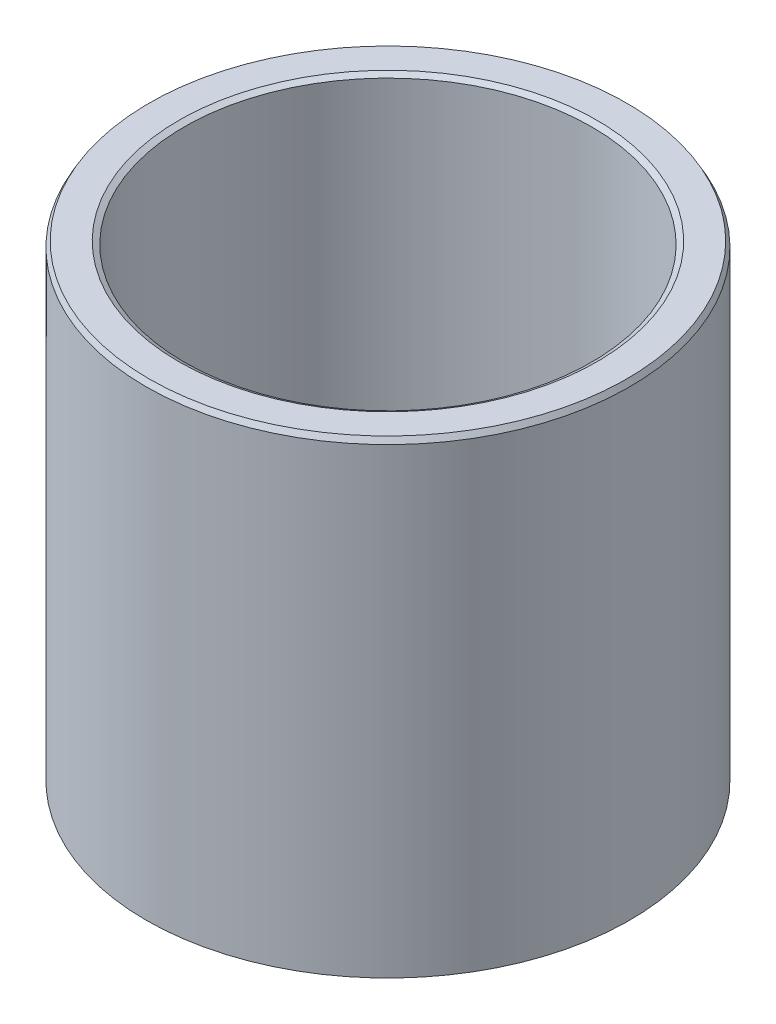
ISO-10303-21;
HEADER;
FILE_DESCRIPTION(('STEP AP214'),'2;1');
FILE_NAME('part.step','',(''),(''),'','','');
FILE_SCHEMA(('AUTOMOTIVE_DESIGN { 1 0 10303 214 1 1 1 1 }'));
ENDSEC;
DATA;
#1=APPLICATION_CONTEXT('core data for automotive mechanical design processes');
#2=APPLICATION_PROTOCOL_DEFINITION('international standard','automotive_design',2000,#1);
#3=PRODUCT_CONTEXT('',#1,'mechanical');
#4=PRODUCT('Part','Part','',(#3));
#5=PRODUCT_RELATED_PRODUCT_CATEGORY('part','',(#4));
#6=PRODUCT_DEFINITION_FORMATION('','',#4);
#7=PRODUCT_DEFINITION_CONTEXT('part definition',#1,'design');
#8=PRODUCT_DEFINITION('design','',#6,#7);
#9=PRODUCT_DEFINITION_SHAPE('','',#8);
#10=(LENGTH_UNIT() NAMED_UNIT(*) SI_UNIT(.MILLI.,.METRE.));
#11=(NAMED_UNIT(*) PLANE_ANGLE_UNIT() SI_UNIT($,.RADIAN.));
#12=(NAMED_UNIT(*) SI_UNIT($,.STERADIAN.) SOLID_ANGLE_UNIT());
#13=UNCERTAINTY_MEASURE_WITH_UNIT(LENGTH_MEASURE(1.E-05),#10,'distance_accuracy_value','');
#14=(GEOMETRIC_REPRESENTATION_CONTEXT(3) GLOBAL_UNCERTAINTY_ASSIGNED_CONTEXT((#13)) GLOBAL_UNIT_ASSIGNED_CONTEXT((#10,
#11,#12)) REPRESENTATION_CONTEXT('',''));
#15=CARTESIAN_POINT('',(0.,0.,0.));
#16=DIRECTION('',(0.,0.,1.));
#17=DIRECTION('',(1.,0.,0.));
#18=AXIS2_PLACEMENT_3D('',#15,#16,#17);
#19=CARTESIAN_POINT('',(0.,82.6490194078143,0.));
#20=DIRECTION('',(0.,-1.,0.));
#21=DIRECTION('',(0.,0.,-1.));
#22=AXIS2_PLACEMENT_3D('',#19,#20,#21);
#23=CYLINDRICAL_SURFACE('',#22,42.5);
#24=CARTESIAN_POINT('',(0.,0.527436922569194,0.));
#25=DIRECTION('',(0.,1.,0.));
#26=DIRECTION('',(0.,0.,1.));
#27=AXIS2_PLACEMENT_3D('',#24,#25,#26);
#28=CIRCLE('',#27,42.5);
#29=CARTESIAN_POINT('',(0.,0.527436922569194,42.5));
#30=VERTEX_POINT('',#29);
#31=EDGE_CURVE('E10',#30,#30,#28,.T.);
#32=ORIENTED_EDGE('',*,*,#31,.T.);
#33=EDGE_LOOP('',(#32));
#34=FACE_BOUND('',#33,.T.);
#35=CARTESIAN_POINT('',(0.,81.7123658292591,0.));
#36=DIRECTION('',(0.,1.,0.));
#37=DIRECTION('',(0.,0.,1.));
#38=AXIS2_PLACEMENT_3D('',#35,#36,#37);
#39=CIRCLE('',#38,42.5);
#40=CARTESIAN_POINT('',(0.,81.7123658292591,42.5));
#41=VERTEX_POINT('',#40);
#42=EDGE_CURVE('E50',#41,#41,#39,.F.);
#43=ORIENTED_EDGE('',*,*,#42,.T.);
#44=EDGE_LOOP('',(#43));
#45=FACE_BOUND('',#44,.T.);
#46=ADVANCED_FACE('F39',(#34,#45),#23,.T.);
#47=CARTESIAN_POINT('',(0.,82.6490194078143,0.));
#48=DIRECTION('',(0.,1.,0.));
#49=DIRECTION('',(0.,0.,1.));
#50=AXIS2_PLACEMENT_3D('',#47,#48,#49);
#51=PLANE('',#50);
#52=CARTESIAN_POINT('',(0.,82.6490194078143,0.));
#53=DIRECTION('',(0.,1.,0.));
#54=DIRECTION('',(0.,0.,1.));
#55=AXIS2_PLACEMENT_3D('',#52,#53,#54);
#56=CIRCLE('',#55,36.7487661700512);
#57=CARTESIAN_POINT('',(0.,82.6490194078143,36.7487661700512));
#58=VERTEX_POINT('',#57);
#59=EDGE_CURVE('E58',#58,#58,#56,.F.);
#60=ORIENTED_EDGE('',*,*,#59,.T.);
#61=EDGE_LOOP('',(#60));
#62=FACE_BOUND('',#61,.T.);
#63=CARTESIAN_POINT('',(0.,82.6490194078143,0.));
#64=DIRECTION('',(0.,1.,0.));
#65=DIRECTION('',(0.,0.,1.));
#66=AXIS2_PLACEMENT_3D('',#63,#64,#65);
#67=CIRCLE('',#66,41.9725630774308);
#68=CARTESIAN_POINT('',(0.,82.6490194078143,41.9725630774308));
#69=VERTEX_POINT('',#68);
#70=EDGE_CURVE('E61',#69,#69,#67,.T.);
#71=ORIENTED_EDGE('',*,*,#70,.T.);
#72=EDGE_LOOP('',(#71));
#73=FACE_BOUND('',#72,.T.);
#74=ADVANCED_FACE('F88',(#62,#73),#51,.T.);
#75=CARTESIAN_POINT('',(0.,0.,0.));
#76=DIRECTION('',(0.,1.,0.));
#77=DIRECTION('',(0.,0.,1.));
#78=AXIS2_PLACEMENT_3D('',#75,#76,#77);
#79=PLANE('',#78);
#80=CARTESIAN_POINT('',(0.,0.,0.));
#81=DIRECTION('',(0.,1.,0.));
#82=DIRECTION('',(0.,0.,1.));
#83=AXIS2_PLACEMENT_3D('',#80,#81,#82);
#84=CIRCLE('',#83,36.3395495140653);
#85=CARTESIAN_POINT('',(0.,0.,36.3395495140653));
#86=VERTEX_POINT('',#85);
#87=EDGE_CURVE('E51',#86,#86,#84,.T.);
#88=ORIENTED_EDGE('',*,*,#87,.T.);
#89=EDGE_LOOP('',(#88));
#90=FACE_BOUND('',#89,.T.);
#91=CARTESIAN_POINT('',(0.,0.,0.));
#92=DIRECTION('',(0.,1.,0.));
#93=DIRECTION('',(0.,0.,1.));
#94=AXIS2_PLACEMENT_3D('',#91,#92,#93);
#95=CIRCLE('',#94,41.5633464214449);
#96=CARTESIAN_POINT('',(0.,0.,41.5633464214449));
#97=VERTEX_POINT('',#96);
#98=EDGE_CURVE('E54',#97,#97,#95,.F.);
#99=ORIENTED_EDGE('',*,*,#98,.T.);
#100=EDGE_LOOP('',(#99));
#101=FACE_BOUND('',#100,.T.);
#102=ADVANCED_FACE('F83',(#90,#101),#79,.F.);
#103=CARTESIAN_POINT('',(0.,82.6490194078143,0.));
#104=DIRECTION('',(0.,-1.,0.));
#105=DIRECTION('',(0.,0.,-1.));
#106=AXIS2_PLACEMENT_3D('',#103,#104,#105);
#107=CYLINDRICAL_SURFACE('',#106,35.8121125914961);
#108=CARTESIAN_POINT('',(0.,82.1215824852451,0.));
#109=DIRECTION('',(0.,1.,0.));
#110=DIRECTION('',(0.,0.,1.));
#111=AXIS2_PLACEMENT_3D('',#108,#109,#110);
#112=CIRCLE('',#111,35.8121125914961);
#113=CARTESIAN_POINT('',(0.,82.1215824852451,35.8121125914961));
#114=VERTEX_POINT('',#113);
#115=EDGE_CURVE('E67',#114,#114,#112,.T.);
#116=ORIENTED_EDGE('',*,*,#115,.T.);
#117=EDGE_LOOP('',(#116));
#118=FACE_BOUND('',#117,.T.);
#119=CARTESIAN_POINT('',(0.,0.93665357855513,0.));
#120=DIRECTION('',(0.,1.,0.));
#121=DIRECTION('',(0.,0.,1.));
#122=AXIS2_PLACEMENT_3D('',#119,#120,#121);
#123=CIRCLE('',#122,35.8121125914961);
#124=CARTESIAN_POINT('',(0.,0.93665357855513,35.8121125914961));
#125=VERTEX_POINT('',#124);
#126=EDGE_CURVE('E69',#125,#125,#123,.F.);
#127=ORIENTED_EDGE('',*,*,#126,.T.);
#128=EDGE_LOOP('',(#127));
#129=FACE_BOUND('',#128,.T.);
#130=ADVANCED_FACE('F71',(#118,#129),#107,.F.);
#131=CARTESIAN_POINT('',(0.,82.1215824852451,0.));
#132=DIRECTION('',(0.,1.,0.));
#133=DIRECTION('',(0.,0.,1.));
#134=AXIS2_PLACEMENT_3D('',#131,#132,#133);
#135=CONICAL_SURFACE('',#134,35.8121125914961,1.05794528569812);
#136=ORIENTED_EDGE('',*,*,#59,.F.);
#137=EDGE_LOOP('',(#136));
#138=FACE_BOUND('',#137,.T.);
#139=ORIENTED_EDGE('',*,*,#115,.F.);
#140=EDGE_LOOP('',(#139));
#141=FACE_BOUND('',#140,.T.);
#142=ADVANCED_FACE('F77',(#138,#141),#135,.F.);
#143=CARTESIAN_POINT('',(0.,0.,0.));
#144=DIRECTION('',(0.,-1.,0.));
#145=DIRECTION('',(0.,0.,-1.));
#146=AXIS2_PLACEMENT_3D('',#143,#144,#145);
#147=CONICAL_SURFACE('',#146,36.3395495140653,0.51285104109678);
#148=ORIENTED_EDGE('',*,*,#126,.F.);
#149=EDGE_LOOP('',(#148));
#150=FACE_BOUND('',#149,.T.);
#151=ORIENTED_EDGE('',*,*,#87,.F.);
#152=EDGE_LOOP('',(#151));
#153=FACE_BOUND('',#152,.T.);
#154=ADVANCED_FACE('F73',(#150,#153),#147,.F.);
#155=CARTESIAN_POINT('',(0.,0.527436922569194,0.));
#156=DIRECTION('',(0.,1.,0.));
#157=DIRECTION('',(0.,0.,1.));
#158=AXIS2_PLACEMENT_3D('',#155,#156,#157);
#159=CONICAL_SURFACE('',#158,42.5,1.05794528569812);
#160=ORIENTED_EDGE('',*,*,#98,.F.);
#161=EDGE_LOOP('',(#160));
#162=FACE_BOUND('',#161,.T.);
#163=ORIENTED_EDGE('',*,*,#31,.F.);
#164=EDGE_LOOP('',(#163));
#165=FACE_BOUND('',#164,.T.);
#166=ADVANCED_FACE('F76',(#162,#165),#159,.T.);
#167=CARTESIAN_POINT('',(0.,82.6490194078143,0.));
#168=DIRECTION('',(0.,-1.,0.));
#169=DIRECTION('',(0.,0.,-1.));
#170=AXIS2_PLACEMENT_3D('',#167,#168,#169);
#171=CONICAL_SURFACE('',#170,41.9725630774308,0.512851041096774);
#172=ORIENTED_EDGE('',*,*,#42,.F.);
#173=EDGE_LOOP('',(#172));
#174=FACE_BOUND('',#173,.T.);
#175=ORIENTED_EDGE('',*,*,#70,.F.);
#176=EDGE_LOOP('',(#175));
#177=FACE_BOUND('',#176,.T.);
#178=ADVANCED_FACE('F45',(#174,#177),#171,.T.);
#179=CLOSED_SHELL('',(#46,#74,#102,#130,#142,#154,#166,#178));
#180=MANIFOLD_SOLID_BREP('B2',#179);
#181=ADVANCED_BREP_SHAPE_REPRESENTATION('',(#18,#180),#14);
#182=SHAPE_DEFINITION_REPRESENTATION(#9,#181);
ENDSEC;
END-ISO-10303-21;
